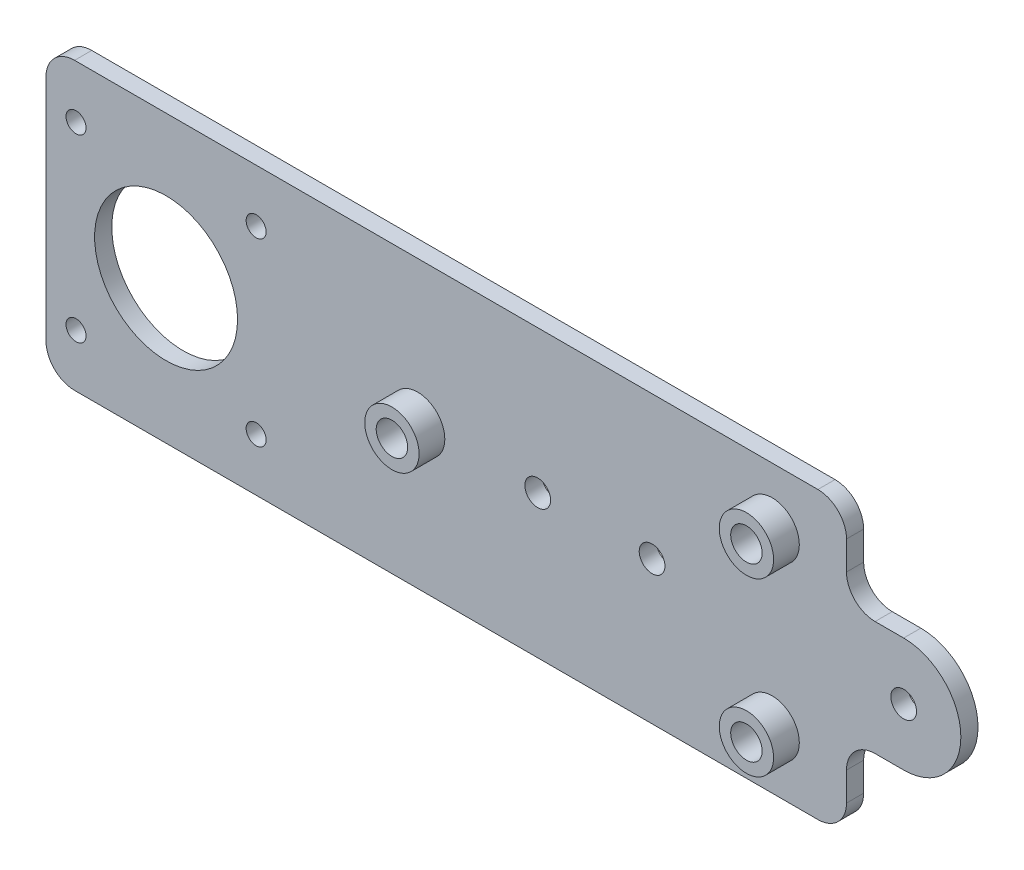
ISO-10303-21;
HEADER;
FILE_DESCRIPTION(('STEP AP214'),'2;1');
FILE_NAME('part.step','',(''),(''),'','','');
FILE_SCHEMA(('AUTOMOTIVE_DESIGN { 1 0 10303 214 1 1 1 1 }'));
ENDSEC;
DATA;
#1=APPLICATION_CONTEXT('core data for automotive mechanical design processes');
#2=APPLICATION_PROTOCOL_DEFINITION('international standard','automotive_design',2000,#1);
#3=PRODUCT_CONTEXT('',#1,'mechanical');
#4=PRODUCT('Part','Part','',(#3));
#5=PRODUCT_RELATED_PRODUCT_CATEGORY('part','',(#4));
#6=PRODUCT_DEFINITION_FORMATION('','',#4);
#7=PRODUCT_DEFINITION_CONTEXT('part definition',#1,'design');
#8=PRODUCT_DEFINITION('design','',#6,#7);
#9=PRODUCT_DEFINITION_SHAPE('','',#8);
#10=(LENGTH_UNIT() NAMED_UNIT(*) SI_UNIT(.MILLI.,.METRE.));
#11=(NAMED_UNIT(*) PLANE_ANGLE_UNIT() SI_UNIT($,.RADIAN.));
#12=(NAMED_UNIT(*) SI_UNIT($,.STERADIAN.) SOLID_ANGLE_UNIT());
#13=UNCERTAINTY_MEASURE_WITH_UNIT(LENGTH_MEASURE(1.E-05),#10,'distance_accuracy_value','');
#14=(GEOMETRIC_REPRESENTATION_CONTEXT(3) GLOBAL_UNCERTAINTY_ASSIGNED_CONTEXT((#13)) GLOBAL_UNIT_ASSIGNED_CONTEXT((#10,
#11,#12)) REPRESENTATION_CONTEXT('',''));
#15=CARTESIAN_POINT('',(0.,0.,0.));
#16=DIRECTION('',(0.,0.,1.));
#17=DIRECTION('',(1.,0.,0.));
#18=AXIS2_PLACEMENT_3D('',#15,#16,#17);
#19=CARTESIAN_POINT('',(70.,20.,3.));
#20=DIRECTION('',(-1.,0.,0.));
#21=DIRECTION('',(0.,0.,1.));
#22=AXIS2_PLACEMENT_3D('',#19,#20,#21);
#23=PLANE('',#22);
#24=DIRECTION('',(0.,1.,0.));
#25=VECTOR('',#24,1.);
#26=CARTESIAN_POINT('',(70.,20.,0.));
#27=LINE('',#26,#25);
#28=CARTESIAN_POINT('',(70.,-20.,0.));
#29=VERTEX_POINT('',#28);
#30=CARTESIAN_POINT('',(70.,-15.,0.));
#31=VERTEX_POINT('',#30);
#32=EDGE_CURVE('E259',#29,#31,#27,.T.);
#33=ORIENTED_EDGE('',*,*,#32,.T.);
#34=DIRECTION('',(0.,0.,-1.));
#35=VECTOR('',#34,1.);
#36=CARTESIAN_POINT('',(70.,-15.,3.));
#37=LINE('',#36,#35);
#38=CARTESIAN_POINT('',(70.,-15.,3.));
#39=VERTEX_POINT('',#38);
#40=EDGE_CURVE('E298',#31,#39,#37,.F.);
#41=ORIENTED_EDGE('',*,*,#40,.T.);
#42=DIRECTION('',(0.,1.,0.));
#43=VECTOR('',#42,1.);
#44=CARTESIAN_POINT('',(70.,20.,3.));
#45=LINE('',#44,#43);
#46=CARTESIAN_POINT('',(70.,-20.,3.));
#47=VERTEX_POINT('',#46);
#48=EDGE_CURVE('E241',#47,#39,#45,.T.);
#49=ORIENTED_EDGE('',*,*,#48,.F.);
#50=DIRECTION('',(0.,0.,-1.));
#51=VECTOR('',#50,1.);
#52=CARTESIAN_POINT('',(70.,-20.,3.));
#53=LINE('',#52,#51);
#54=EDGE_CURVE('E293',#47,#29,#53,.T.);
#55=ORIENTED_EDGE('',*,*,#54,.T.);
#56=EDGE_LOOP('',(#33,#41,#49,#55));
#57=FACE_BOUND('',#56,.T.);
#58=ADVANCED_FACE('F38',(#57),#23,.F.);
#59=CARTESIAN_POINT('',(65.,-20.,3.));
#60=DIRECTION('',(0.,0.,1.));
#61=DIRECTION('',(1.,0.,0.));
#62=AXIS2_PLACEMENT_3D('',#59,#60,#61);
#63=PLANE('',#62);
#64=CARTESIAN_POINT('',(16.,0.,3.));
#65=DIRECTION('',(0.,0.,1.));
#66=DIRECTION('',(1.,0.,0.));
#67=AXIS2_PLACEMENT_3D('',#64,#65,#66);
#68=CIRCLE('',#67,2.25);
#69=CARTESIAN_POINT('',(18.25,0.,3.));
#70=VERTEX_POINT('',#69);
#71=EDGE_CURVE('E370',#70,#70,#68,.T.);
#72=ORIENTED_EDGE('',*,*,#71,.F.);
#73=EDGE_LOOP('',(#72));
#74=FACE_BOUND('',#73,.T.);
#75=CARTESIAN_POINT('',(36.,0.,3.));
#76=DIRECTION('',(0.,0.,1.));
#77=DIRECTION('',(1.,0.,0.));
#78=AXIS2_PLACEMENT_3D('',#75,#76,#77);
#79=CIRCLE('',#78,2.25);
#80=CARTESIAN_POINT('',(38.25,0.,3.));
#81=VERTEX_POINT('',#80);
#82=EDGE_CURVE('E367',#81,#81,#79,.T.);
#83=ORIENTED_EDGE('',*,*,#82,.F.);
#84=EDGE_LOOP('',(#83));
#85=FACE_BOUND('',#84,.T.);
#86=CARTESIAN_POINT('',(-4.99999999999999,0.,3.));
#87=DIRECTION('',(0.,0.,1.));
#88=DIRECTION('',(1.,0.,0.));
#89=AXIS2_PLACEMENT_3D('',#86,#87,#88);
#90=CIRCLE('',#89,4.75);
#91=CARTESIAN_POINT('',(-0.249999999999989,0.,3.));
#92=VERTEX_POINT('',#91);
#93=EDGE_CURVE('E180',#92,#92,#90,.T.);
#94=ORIENTED_EDGE('',*,*,#93,.F.);
#95=EDGE_LOOP('',(#94));
#96=FACE_BOUND('',#95,.T.);
#97=CARTESIAN_POINT('',(65.,-20.,3.));
#98=DIRECTION('',(0.,0.,1.));
#99=DIRECTION('',(1.,0.,0.));
#100=AXIS2_PLACEMENT_3D('',#97,#98,#99);
#101=CIRCLE('',#100,5.);
#102=CARTESIAN_POINT('',(65.,-25.,3.));
#103=VERTEX_POINT('',#102);
#104=EDGE_CURVE('E237',#103,#47,#101,.T.);
#105=ORIENTED_EDGE('',*,*,#104,.T.);
#106=ORIENTED_EDGE('',*,*,#48,.T.);
#107=CARTESIAN_POINT('',(75.,-15.,3.));
#108=DIRECTION('',(0.,0.,1.));
#109=DIRECTION('',(1.,0.,0.));
#110=AXIS2_PLACEMENT_3D('',#107,#108,#109);
#111=CIRCLE('',#110,5.);
#112=CARTESIAN_POINT('',(75.,-10.,3.));
#113=VERTEX_POINT('',#112);
#114=EDGE_CURVE('E146',#39,#113,#111,.F.);
#115=ORIENTED_EDGE('',*,*,#114,.T.);
#116=DIRECTION('',(1.,0.,0.));
#117=VECTOR('',#116,1.);
#118=CARTESIAN_POINT('',(0.,-10.0000000000002,3.));
#119=LINE('',#118,#117);
#120=CARTESIAN_POINT('',(80.,-10.,3.));
#121=VERTEX_POINT('',#120);
#122=EDGE_CURVE('E137',#113,#121,#119,.T.);
#123=ORIENTED_EDGE('',*,*,#122,.T.);
#124=CARTESIAN_POINT('',(80.,0.,3.));
#125=DIRECTION('',(0.,0.,1.));
#126=DIRECTION('',(1.,0.,0.));
#127=AXIS2_PLACEMENT_3D('',#124,#125,#126);
#128=CIRCLE('',#127,10.);
#129=CARTESIAN_POINT('',(80.,10.,3.));
#130=VERTEX_POINT('',#129);
#131=EDGE_CURVE('E142',#121,#130,#128,.T.);
#132=ORIENTED_EDGE('',*,*,#131,.T.);
#133=DIRECTION('',(1.,0.,0.));
#134=VECTOR('',#133,1.);
#135=CARTESIAN_POINT('',(0.,9.99999999999985,3.));
#136=LINE('',#135,#134);
#137=CARTESIAN_POINT('',(75.,9.99999999999999,3.));
#138=VERTEX_POINT('',#137);
#139=EDGE_CURVE('E160',#138,#130,#136,.T.);
#140=ORIENTED_EDGE('',*,*,#139,.F.);
#141=CARTESIAN_POINT('',(75.,15.,3.));
#142=DIRECTION('',(0.,0.,1.));
#143=DIRECTION('',(1.,0.,0.));
#144=AXIS2_PLACEMENT_3D('',#141,#142,#143);
#145=CIRCLE('',#144,5.);
#146=CARTESIAN_POINT('',(70.,15.,3.));
#147=VERTEX_POINT('',#146);
#148=EDGE_CURVE('E11',#138,#147,#145,.F.);
#149=ORIENTED_EDGE('',*,*,#148,.T.);
#150=CARTESIAN_POINT('',(70.,20.,3.));
#151=VERTEX_POINT('',#150);
#152=EDGE_CURVE('E239',#147,#151,#45,.T.);
#153=ORIENTED_EDGE('',*,*,#152,.T.);
#154=CARTESIAN_POINT('',(65.,20.,3.));
#155=DIRECTION('',(0.,0.,1.));
#156=DIRECTION('',(-1.,0.,0.));
#157=AXIS2_PLACEMENT_3D('',#154,#155,#156);
#158=CIRCLE('',#157,5.);
#159=CARTESIAN_POINT('',(65.,25.,3.));
#160=VERTEX_POINT('',#159);
#161=EDGE_CURVE('E243',#151,#160,#158,.T.);
#162=ORIENTED_EDGE('',*,*,#161,.T.);
#163=DIRECTION('',(-1.,0.,0.));
#164=VECTOR('',#163,1.);
#165=CARTESIAN_POINT('',(-65.,25.,3.));
#166=LINE('',#165,#164);
#167=CARTESIAN_POINT('',(-65.,25.,3.));
#168=VERTEX_POINT('',#167);
#169=EDGE_CURVE('E245',#160,#168,#166,.T.);
#170=ORIENTED_EDGE('',*,*,#169,.T.);
#171=CARTESIAN_POINT('',(-65.,20.,3.));
#172=DIRECTION('',(0.,0.,1.));
#173=DIRECTION('',(1.,0.,0.));
#174=AXIS2_PLACEMENT_3D('',#171,#172,#173);
#175=CIRCLE('',#174,5.);
#176=CARTESIAN_POINT('',(-70.,20.,3.));
#177=VERTEX_POINT('',#176);
#178=EDGE_CURVE('E247',#168,#177,#175,.T.);
#179=ORIENTED_EDGE('',*,*,#178,.T.);
#180=DIRECTION('',(0.,-1.,0.));
#181=VECTOR('',#180,1.);
#182=CARTESIAN_POINT('',(-70.,20.,3.));
#183=LINE('',#182,#181);
#184=CARTESIAN_POINT('',(-70.,-20.,3.));
#185=VERTEX_POINT('',#184);
#186=EDGE_CURVE('E249',#177,#185,#183,.T.);
#187=ORIENTED_EDGE('',*,*,#186,.T.);
#188=CARTESIAN_POINT('',(-65.,-20.,3.));
#189=DIRECTION('',(0.,0.,1.));
#190=DIRECTION('',(1.,0.,0.));
#191=AXIS2_PLACEMENT_3D('',#188,#189,#190);
#192=CIRCLE('',#191,5.);
#193=CARTESIAN_POINT('',(-65.,-25.,3.));
#194=VERTEX_POINT('',#193);
#195=EDGE_CURVE('E251',#185,#194,#192,.T.);
#196=ORIENTED_EDGE('',*,*,#195,.T.);
#197=DIRECTION('',(1.,0.,0.));
#198=VECTOR('',#197,1.);
#199=CARTESIAN_POINT('',(-65.,-25.,3.));
#200=LINE('',#199,#198);
#201=EDGE_CURVE('E253',#194,#103,#200,.T.);
#202=ORIENTED_EDGE('',*,*,#201,.T.);
#203=EDGE_LOOP('',(#105,#106,#115,#123,#132,#140,#149,#153,#162,#170,#179,#187,#196,#202));
#204=FACE_BOUND('',#203,.T.);
#205=CARTESIAN_POINT('',(-64.75,15.75,3.));
#206=DIRECTION('',(0.,0.,1.));
#207=DIRECTION('',(1.,0.,0.));
#208=AXIS2_PLACEMENT_3D('',#205,#206,#207);
#209=CIRCLE('',#208,1.75);
#210=CARTESIAN_POINT('',(-63.,15.75,3.));
#211=VERTEX_POINT('',#210);
#212=EDGE_CURVE('E215',#211,#211,#209,.T.);
#213=ORIENTED_EDGE('',*,*,#212,.F.);
#214=EDGE_LOOP('',(#213));
#215=FACE_BOUND('',#214,.T.);
#216=CARTESIAN_POINT('',(-49.,0.,3.));
#217=DIRECTION('',(0.,0.,1.));
#218=DIRECTION('',(1.,0.,0.));
#219=AXIS2_PLACEMENT_3D('',#216,#217,#218);
#220=CIRCLE('',#219,12.5);
#221=CARTESIAN_POINT('',(-36.5,0.,3.));
#222=VERTEX_POINT('',#221);
#223=EDGE_CURVE('E205',#222,#222,#220,.T.);
#224=ORIENTED_EDGE('',*,*,#223,.F.);
#225=EDGE_LOOP('',(#224));
#226=FACE_BOUND('',#225,.T.);
#227=CARTESIAN_POINT('',(-33.25,-15.75,3.));
#228=DIRECTION('',(0.,0.,1.));
#229=DIRECTION('',(1.,0.,0.));
#230=AXIS2_PLACEMENT_3D('',#227,#228,#229);
#231=CIRCLE('',#230,1.75);
#232=CARTESIAN_POINT('',(-31.5,-15.75,3.));
#233=VERTEX_POINT('',#232);
#234=EDGE_CURVE('E198',#233,#233,#231,.T.);
#235=ORIENTED_EDGE('',*,*,#234,.F.);
#236=EDGE_LOOP('',(#235));
#237=FACE_BOUND('',#236,.T.);
#238=CARTESIAN_POINT('',(-64.75,-15.75,3.));
#239=DIRECTION('',(0.,0.,1.));
#240=DIRECTION('',(1.,0.,0.));
#241=AXIS2_PLACEMENT_3D('',#238,#239,#240);
#242=CIRCLE('',#241,1.75);
#243=CARTESIAN_POINT('',(-63.,-15.75,3.));
#244=VERTEX_POINT('',#243);
#245=EDGE_CURVE('E219',#244,#244,#242,.T.);
#246=ORIENTED_EDGE('',*,*,#245,.F.);
#247=EDGE_LOOP('',(#246));
#248=FACE_BOUND('',#247,.T.);
#249=CARTESIAN_POINT('',(-33.25,15.75,3.));
#250=DIRECTION('',(0.,0.,1.));
#251=DIRECTION('',(1.,0.,0.));
#252=AXIS2_PLACEMENT_3D('',#249,#250,#251);
#253=CIRCLE('',#252,1.75);
#254=CARTESIAN_POINT('',(-31.5,15.75,3.));
#255=VERTEX_POINT('',#254);
#256=EDGE_CURVE('E212',#255,#255,#253,.T.);
#257=ORIENTED_EDGE('',*,*,#256,.F.);
#258=EDGE_LOOP('',(#257));
#259=FACE_BOUND('',#258,.T.);
#260=CARTESIAN_POINT('',(57.,15.,3.));
#261=DIRECTION('',(0.,0.,1.));
#262=DIRECTION('',(1.,0.,0.));
#263=AXIS2_PLACEMENT_3D('',#260,#261,#262);
#264=CIRCLE('',#263,4.75);
#265=CARTESIAN_POINT('',(61.75,15.,3.));
#266=VERTEX_POINT('',#265);
#267=EDGE_CURVE('E191',#266,#266,#264,.T.);
#268=ORIENTED_EDGE('',*,*,#267,.F.);
#269=EDGE_LOOP('',(#268));
#270=FACE_BOUND('',#269,.T.);
#271=CARTESIAN_POINT('',(57.,-15.,3.));
#272=DIRECTION('',(0.,0.,1.));
#273=DIRECTION('',(1.,0.,0.));
#274=AXIS2_PLACEMENT_3D('',#271,#272,#273);
#275=CIRCLE('',#274,4.75);
#276=CARTESIAN_POINT('',(61.75,-15.,3.));
#277=VERTEX_POINT('',#276);
#278=EDGE_CURVE('E169',#277,#277,#275,.T.);
#279=ORIENTED_EDGE('',*,*,#278,.F.);
#280=EDGE_LOOP('',(#279));
#281=FACE_BOUND('',#280,.T.);
#282=CARTESIAN_POINT('',(80.,0.,3.));
#283=DIRECTION('',(0.,0.,1.));
#284=DIRECTION('',(1.,0.,0.));
#285=AXIS2_PLACEMENT_3D('',#282,#283,#284);
#286=CIRCLE('',#285,2.25);
#287=CARTESIAN_POINT('',(82.25,0.,3.));
#288=VERTEX_POINT('',#287);
#289=EDGE_CURVE('E151',#288,#288,#286,.T.);
#290=ORIENTED_EDGE('',*,*,#289,.F.);
#291=EDGE_LOOP('',(#290));
#292=FACE_BOUND('',#291,.T.);
#293=ADVANCED_FACE('F140',(#74,#85,#96,#204,#215,#226,#237,#248,#259,#270,#281,#292),#63,.T.);
#294=CARTESIAN_POINT('',(65.,-20.,3.));
#295=DIRECTION('',(0.,0.,-1.));
#296=DIRECTION('',(-1.,0.,0.));
#297=AXIS2_PLACEMENT_3D('',#294,#295,#296);
#298=CYLINDRICAL_SURFACE('',#297,5.);
#299=CARTESIAN_POINT('',(65.,-20.,0.));
#300=DIRECTION('',(0.,0.,1.));
#301=DIRECTION('',(1.,0.,0.));
#302=AXIS2_PLACEMENT_3D('',#299,#300,#301);
#303=CIRCLE('',#302,5.);
#304=CARTESIAN_POINT('',(65.,-25.,0.));
#305=VERTEX_POINT('',#304);
#306=EDGE_CURVE('E234',#305,#29,#303,.T.);
#307=ORIENTED_EDGE('',*,*,#306,.T.);
#308=ORIENTED_EDGE('',*,*,#54,.F.);
#309=ORIENTED_EDGE('',*,*,#104,.F.);
#310=DIRECTION('',(0.,0.,-1.));
#311=VECTOR('',#310,1.);
#312=CARTESIAN_POINT('',(65.,-25.,3.));
#313=LINE('',#312,#311);
#314=EDGE_CURVE('E255',#103,#305,#313,.T.);
#315=ORIENTED_EDGE('',*,*,#314,.T.);
#316=EDGE_LOOP('',(#307,#308,#309,#315));
#317=FACE_BOUND('',#316,.T.);
#318=ADVANCED_FACE('F332',(#317),#298,.T.);
#319=ORIENTED_EDGE('',*,*,#152,.F.);
#320=DIRECTION('',(0.,0.,-1.));
#321=VECTOR('',#320,1.);
#322=CARTESIAN_POINT('',(70.,15.,3.));
#323=LINE('',#322,#321);
#324=CARTESIAN_POINT('',(70.,15.,0.));
#325=VERTEX_POINT('',#324);
#326=EDGE_CURVE('E300',#147,#325,#323,.T.);
#327=ORIENTED_EDGE('',*,*,#326,.T.);
#328=CARTESIAN_POINT('',(70.,20.,0.));
#329=VERTEX_POINT('',#328);
#330=EDGE_CURVE('E258',#325,#329,#27,.T.);
#331=ORIENTED_EDGE('',*,*,#330,.T.);
#332=DIRECTION('',(0.,0.,-1.));
#333=VECTOR('',#332,1.);
#334=CARTESIAN_POINT('',(70.,20.,3.));
#335=LINE('',#334,#333);
#336=EDGE_CURVE('E290',#151,#329,#335,.T.);
#337=ORIENTED_EDGE('',*,*,#336,.F.);
#338=EDGE_LOOP('',(#319,#327,#331,#337));
#339=FACE_BOUND('',#338,.T.);
#340=ADVANCED_FACE('F328',(#339),#23,.F.);
#341=CARTESIAN_POINT('',(65.,20.,3.));
#342=DIRECTION('',(0.,0.,-1.));
#343=DIRECTION('',(-1.,0.,0.));
#344=AXIS2_PLACEMENT_3D('',#341,#342,#343);
#345=CYLINDRICAL_SURFACE('',#344,5.);
#346=CARTESIAN_POINT('',(65.,20.,0.));
#347=DIRECTION('',(0.,0.,1.));
#348=DIRECTION('',(-1.,0.,0.));
#349=AXIS2_PLACEMENT_3D('',#346,#347,#348);
#350=CIRCLE('',#349,5.);
#351=CARTESIAN_POINT('',(65.,25.,0.));
#352=VERTEX_POINT('',#351);
#353=EDGE_CURVE('E262',#329,#352,#350,.T.);
#354=ORIENTED_EDGE('',*,*,#353,.T.);
#355=DIRECTION('',(0.,0.,-1.));
#356=VECTOR('',#355,1.);
#357=CARTESIAN_POINT('',(65.,25.,3.));
#358=LINE('',#357,#356);
#359=EDGE_CURVE('E287',#160,#352,#358,.T.);
#360=ORIENTED_EDGE('',*,*,#359,.F.);
#361=ORIENTED_EDGE('',*,*,#161,.F.);
#362=ORIENTED_EDGE('',*,*,#336,.T.);
#363=EDGE_LOOP('',(#354,#360,#361,#362));
#364=FACE_BOUND('',#363,.T.);
#365=ADVANCED_FACE('F337',(#364),#345,.T.);
#366=CARTESIAN_POINT('',(-65.,25.,3.));
#367=DIRECTION('',(0.,-1.,0.));
#368=DIRECTION('',(0.,0.,-1.));
#369=AXIS2_PLACEMENT_3D('',#366,#367,#368);
#370=PLANE('',#369);
#371=DIRECTION('',(-1.,0.,0.));
#372=VECTOR('',#371,1.);
#373=CARTESIAN_POINT('',(-65.,25.,0.));
#374=LINE('',#373,#372);
#375=CARTESIAN_POINT('',(-65.,25.,0.));
#376=VERTEX_POINT('',#375);
#377=EDGE_CURVE('E264',#352,#376,#374,.T.);
#378=ORIENTED_EDGE('',*,*,#377,.T.);
#379=DIRECTION('',(0.,0.,-1.));
#380=VECTOR('',#379,1.);
#381=CARTESIAN_POINT('',(-65.,25.,3.));
#382=LINE('',#381,#380);
#383=EDGE_CURVE('E284',#168,#376,#382,.T.);
#384=ORIENTED_EDGE('',*,*,#383,.F.);
#385=ORIENTED_EDGE('',*,*,#169,.F.);
#386=ORIENTED_EDGE('',*,*,#359,.T.);
#387=EDGE_LOOP('',(#378,#384,#385,#386));
#388=FACE_BOUND('',#387,.T.);
#389=ADVANCED_FACE('F343',(#388),#370,.F.);
#390=CARTESIAN_POINT('',(-65.,20.,3.));
#391=DIRECTION('',(0.,0.,-1.));
#392=DIRECTION('',(-1.,0.,0.));
#393=AXIS2_PLACEMENT_3D('',#390,#391,#392);
#394=CYLINDRICAL_SURFACE('',#393,5.);
#395=CARTESIAN_POINT('',(-65.,20.,0.));
#396=DIRECTION('',(0.,0.,1.));
#397=DIRECTION('',(1.,0.,0.));
#398=AXIS2_PLACEMENT_3D('',#395,#396,#397);
#399=CIRCLE('',#398,5.);
#400=CARTESIAN_POINT('',(-70.,20.,0.));
#401=VERTEX_POINT('',#400);
#402=EDGE_CURVE('E266',#376,#401,#399,.T.);
#403=ORIENTED_EDGE('',*,*,#402,.T.);
#404=DIRECTION('',(0.,0.,-1.));
#405=VECTOR('',#404,1.);
#406=CARTESIAN_POINT('',(-70.,20.,3.));
#407=LINE('',#406,#405);
#408=EDGE_CURVE('E281',#177,#401,#407,.T.);
#409=ORIENTED_EDGE('',*,*,#408,.F.);
#410=ORIENTED_EDGE('',*,*,#178,.F.);
#411=ORIENTED_EDGE('',*,*,#383,.T.);
#412=EDGE_LOOP('',(#403,#409,#410,#411));
#413=FACE_BOUND('',#412,.T.);
#414=ADVANCED_FACE('F459',(#413),#394,.T.);
#415=CARTESIAN_POINT('',(-70.,20.,3.));
#416=DIRECTION('',(1.,0.,0.));
#417=DIRECTION('',(0.,0.,-1.));
#418=AXIS2_PLACEMENT_3D('',#415,#416,#417);
#419=PLANE('',#418);
#420=DIRECTION('',(0.,-1.,0.));
#421=VECTOR('',#420,1.);
#422=CARTESIAN_POINT('',(-70.,20.,0.));
#423=LINE('',#422,#421);
#424=CARTESIAN_POINT('',(-70.,-20.,0.));
#425=VERTEX_POINT('',#424);
#426=EDGE_CURVE('E268',#401,#425,#423,.T.);
#427=ORIENTED_EDGE('',*,*,#426,.T.);
#428=DIRECTION('',(0.,0.,-1.));
#429=VECTOR('',#428,1.);
#430=CARTESIAN_POINT('',(-70.,-20.,3.));
#431=LINE('',#430,#429);
#432=EDGE_CURVE('E278',#185,#425,#431,.T.);
#433=ORIENTED_EDGE('',*,*,#432,.F.);
#434=ORIENTED_EDGE('',*,*,#186,.F.);
#435=ORIENTED_EDGE('',*,*,#408,.T.);
#436=EDGE_LOOP('',(#427,#433,#434,#435));
#437=FACE_BOUND('',#436,.T.);
#438=ADVANCED_FACE('F455',(#437),#419,.F.);
#439=CARTESIAN_POINT('',(-65.,-20.,3.));
#440=DIRECTION('',(0.,0.,-1.));
#441=DIRECTION('',(-1.,0.,0.));
#442=AXIS2_PLACEMENT_3D('',#439,#440,#441);
#443=CYLINDRICAL_SURFACE('',#442,5.);
#444=CARTESIAN_POINT('',(-65.,-20.,0.));
#445=DIRECTION('',(0.,0.,1.));
#446=DIRECTION('',(1.,0.,0.));
#447=AXIS2_PLACEMENT_3D('',#444,#445,#446);
#448=CIRCLE('',#447,5.);
#449=CARTESIAN_POINT('',(-65.,-25.,0.));
#450=VERTEX_POINT('',#449);
#451=EDGE_CURVE('E270',#425,#450,#448,.T.);
#452=ORIENTED_EDGE('',*,*,#451,.T.);
#453=DIRECTION('',(0.,0.,-1.));
#454=VECTOR('',#453,1.);
#455=CARTESIAN_POINT('',(-65.,-25.,3.));
#456=LINE('',#455,#454);
#457=EDGE_CURVE('E275',#194,#450,#456,.T.);
#458=ORIENTED_EDGE('',*,*,#457,.F.);
#459=ORIENTED_EDGE('',*,*,#195,.F.);
#460=ORIENTED_EDGE('',*,*,#432,.T.);
#461=EDGE_LOOP('',(#452,#458,#459,#460));
#462=FACE_BOUND('',#461,.T.);
#463=ADVANCED_FACE('F451',(#462),#443,.T.);
#464=CARTESIAN_POINT('',(-65.,-25.,3.));
#465=DIRECTION('',(0.,1.,0.));
#466=DIRECTION('',(0.,0.,1.));
#467=AXIS2_PLACEMENT_3D('',#464,#465,#466);
#468=PLANE('',#467);
#469=DIRECTION('',(1.,0.,0.));
#470=VECTOR('',#469,1.);
#471=CARTESIAN_POINT('',(-65.,-25.,0.));
#472=LINE('',#471,#470);
#473=EDGE_CURVE('E240',#450,#305,#472,.T.);
#474=ORIENTED_EDGE('',*,*,#473,.T.);
#475=ORIENTED_EDGE('',*,*,#314,.F.);
#476=ORIENTED_EDGE('',*,*,#201,.F.);
#477=ORIENTED_EDGE('',*,*,#457,.T.);
#478=EDGE_LOOP('',(#474,#475,#476,#477));
#479=FACE_BOUND('',#478,.T.);
#480=ADVANCED_FACE('F448',(#479),#468,.F.);
#481=CARTESIAN_POINT('',(65.,-20.,0.));
#482=DIRECTION('',(0.,0.,1.));
#483=DIRECTION('',(1.,0.,0.));
#484=AXIS2_PLACEMENT_3D('',#481,#482,#483);
#485=PLANE('',#484);
#486=CARTESIAN_POINT('',(16.,0.,0.));
#487=DIRECTION('',(0.,0.,1.));
#488=DIRECTION('',(1.,0.,0.));
#489=AXIS2_PLACEMENT_3D('',#486,#487,#488);
#490=CIRCLE('',#489,2.25);
#491=CARTESIAN_POINT('',(18.25,0.,0.));
#492=VERTEX_POINT('',#491);
#493=EDGE_CURVE('E356',#492,#492,#490,.T.);
#494=ORIENTED_EDGE('',*,*,#493,.T.);
#495=EDGE_LOOP('',(#494));
#496=FACE_BOUND('',#495,.T.);
#497=CARTESIAN_POINT('',(36.,0.,0.));
#498=DIRECTION('',(0.,0.,1.));
#499=DIRECTION('',(1.,0.,0.));
#500=AXIS2_PLACEMENT_3D('',#497,#498,#499);
#501=CIRCLE('',#500,2.25);
#502=CARTESIAN_POINT('',(38.25,0.,0.));
#503=VERTEX_POINT('',#502);
#504=EDGE_CURVE('E364',#503,#503,#501,.T.);
#505=ORIENTED_EDGE('',*,*,#504,.T.);
#506=EDGE_LOOP('',(#505));
#507=FACE_BOUND('',#506,.T.);
#508=CARTESIAN_POINT('',(-4.99999999999999,0.,0.));
#509=DIRECTION('',(0.,0.,1.));
#510=DIRECTION('',(1.,0.,0.));
#511=AXIS2_PLACEMENT_3D('',#508,#509,#510);
#512=CIRCLE('',#511,2.75);
#513=CARTESIAN_POINT('',(-2.24999999999999,0.,0.));
#514=VERTEX_POINT('',#513);
#515=EDGE_CURVE('E195',#514,#514,#512,.T.);
#516=ORIENTED_EDGE('',*,*,#515,.T.);
#517=EDGE_LOOP('',(#516));
#518=FACE_BOUND('',#517,.T.);
#519=CARTESIAN_POINT('',(57.,-15.,0.));
#520=DIRECTION('',(0.,0.,1.));
#521=DIRECTION('',(1.,0.,0.));
#522=AXIS2_PLACEMENT_3D('',#519,#520,#521);
#523=CIRCLE('',#522,2.75);
#524=CARTESIAN_POINT('',(59.75,-15.,0.));
#525=VERTEX_POINT('',#524);
#526=EDGE_CURVE('E226',#525,#525,#523,.T.);
#527=ORIENTED_EDGE('',*,*,#526,.T.);
#528=EDGE_LOOP('',(#527));
#529=FACE_BOUND('',#528,.T.);
#530=CARTESIAN_POINT('',(57.,15.,0.));
#531=DIRECTION('',(0.,0.,1.));
#532=DIRECTION('',(1.,0.,0.));
#533=AXIS2_PLACEMENT_3D('',#530,#531,#532);
#534=CIRCLE('',#533,2.75);
#535=CARTESIAN_POINT('',(59.75,15.,0.));
#536=VERTEX_POINT('',#535);
#537=EDGE_CURVE('E211',#536,#536,#534,.T.);
#538=ORIENTED_EDGE('',*,*,#537,.T.);
#539=EDGE_LOOP('',(#538));
#540=FACE_BOUND('',#539,.T.);
#541=CARTESIAN_POINT('',(-33.25,15.75,0.));
#542=DIRECTION('',(0.,0.,1.));
#543=DIRECTION('',(1.,0.,0.));
#544=AXIS2_PLACEMENT_3D('',#541,#542,#543);
#545=CIRCLE('',#544,1.75);
#546=CARTESIAN_POINT('',(-31.5,15.75,0.));
#547=VERTEX_POINT('',#546);
#548=EDGE_CURVE('E216',#547,#547,#545,.T.);
#549=ORIENTED_EDGE('',*,*,#548,.T.);
#550=EDGE_LOOP('',(#549));
#551=FACE_BOUND('',#550,.T.);
#552=CARTESIAN_POINT('',(-64.75,-15.75,0.));
#553=DIRECTION('',(0.,0.,1.));
#554=DIRECTION('',(1.,0.,0.));
#555=AXIS2_PLACEMENT_3D('',#552,#553,#554);
#556=CIRCLE('',#555,1.75);
#557=CARTESIAN_POINT('',(-63.,-15.75,0.));
#558=VERTEX_POINT('',#557);
#559=EDGE_CURVE('E201',#558,#558,#556,.T.);
#560=ORIENTED_EDGE('',*,*,#559,.T.);
#561=EDGE_LOOP('',(#560));
#562=FACE_BOUND('',#561,.T.);
#563=CARTESIAN_POINT('',(-33.25,-15.75,0.));
#564=DIRECTION('',(0.,0.,1.));
#565=DIRECTION('',(1.,0.,0.));
#566=AXIS2_PLACEMENT_3D('',#563,#564,#565);
#567=CIRCLE('',#566,1.75);
#568=CARTESIAN_POINT('',(-31.5,-15.75,0.));
#569=VERTEX_POINT('',#568);
#570=EDGE_CURVE('E202',#569,#569,#567,.T.);
#571=ORIENTED_EDGE('',*,*,#570,.T.);
#572=EDGE_LOOP('',(#571));
#573=FACE_BOUND('',#572,.T.);
#574=CARTESIAN_POINT('',(-49.,0.,0.));
#575=DIRECTION('',(0.,0.,1.));
#576=DIRECTION('',(1.,0.,0.));
#577=AXIS2_PLACEMENT_3D('',#574,#575,#576);
#578=CIRCLE('',#577,12.5);
#579=CARTESIAN_POINT('',(-36.5,0.,0.));
#580=VERTEX_POINT('',#579);
#581=EDGE_CURVE('E208',#580,#580,#578,.T.);
#582=ORIENTED_EDGE('',*,*,#581,.T.);
#583=EDGE_LOOP('',(#582));
#584=FACE_BOUND('',#583,.T.);
#585=CARTESIAN_POINT('',(-64.75,15.75,0.));
#586=DIRECTION('',(0.,0.,1.));
#587=DIRECTION('',(1.,0.,0.));
#588=AXIS2_PLACEMENT_3D('',#585,#586,#587);
#589=CIRCLE('',#588,1.75);
#590=CARTESIAN_POINT('',(-63.,15.75,0.));
#591=VERTEX_POINT('',#590);
#592=EDGE_CURVE('E231',#591,#591,#589,.T.);
#593=ORIENTED_EDGE('',*,*,#592,.T.);
#594=EDGE_LOOP('',(#593));
#595=FACE_BOUND('',#594,.T.);
#596=ORIENTED_EDGE('',*,*,#306,.F.);
#597=ORIENTED_EDGE('',*,*,#473,.F.);
#598=ORIENTED_EDGE('',*,*,#451,.F.);
#599=ORIENTED_EDGE('',*,*,#426,.F.);
#600=ORIENTED_EDGE('',*,*,#402,.F.);
#601=ORIENTED_EDGE('',*,*,#377,.F.);
#602=ORIENTED_EDGE('',*,*,#353,.F.);
#603=ORIENTED_EDGE('',*,*,#330,.F.);
#604=CARTESIAN_POINT('',(75.,15.,0.));
#605=DIRECTION('',(0.,0.,1.));
#606=DIRECTION('',(1.,0.,0.));
#607=AXIS2_PLACEMENT_3D('',#604,#605,#606);
#608=CIRCLE('',#607,5.);
#609=CARTESIAN_POINT('',(75.,9.99999999999999,0.));
#610=VERTEX_POINT('',#609);
#611=EDGE_CURVE('E46',#325,#610,#608,.T.);
#612=ORIENTED_EDGE('',*,*,#611,.T.);
#613=DIRECTION('',(1.,0.,0.));
#614=VECTOR('',#613,1.);
#615=CARTESIAN_POINT('',(0.,9.99999999999985,0.));
#616=LINE('',#615,#614);
#617=CARTESIAN_POINT('',(80.,10.,0.));
#618=VERTEX_POINT('',#617);
#619=EDGE_CURVE('E359',#610,#618,#616,.T.);
#620=ORIENTED_EDGE('',*,*,#619,.T.);
#621=CARTESIAN_POINT('',(80.,0.,0.));
#622=DIRECTION('',(0.,0.,1.));
#623=DIRECTION('',(1.,0.,0.));
#624=AXIS2_PLACEMENT_3D('',#621,#622,#623);
#625=CIRCLE('',#624,10.);
#626=CARTESIAN_POINT('',(80.,-10.,0.));
#627=VERTEX_POINT('',#626);
#628=EDGE_CURVE('E358',#627,#618,#625,.T.);
#629=ORIENTED_EDGE('',*,*,#628,.F.);
#630=DIRECTION('',(1.,0.,0.));
#631=VECTOR('',#630,1.);
#632=CARTESIAN_POINT('',(0.,-10.0000000000002,0.));
#633=LINE('',#632,#631);
#634=CARTESIAN_POINT('',(75.,-10.,0.));
#635=VERTEX_POINT('',#634);
#636=EDGE_CURVE('E164',#635,#627,#633,.T.);
#637=ORIENTED_EDGE('',*,*,#636,.F.);
#638=CARTESIAN_POINT('',(75.,-15.,0.));
#639=DIRECTION('',(0.,0.,1.));
#640=DIRECTION('',(1.,0.,0.));
#641=AXIS2_PLACEMENT_3D('',#638,#639,#640);
#642=CIRCLE('',#641,5.);
#643=EDGE_CURVE('E304',#635,#31,#642,.T.);
#644=ORIENTED_EDGE('',*,*,#643,.T.);
#645=ORIENTED_EDGE('',*,*,#32,.F.);
#646=EDGE_LOOP('',(#596,#597,#598,#599,#600,#601,#602,#603,#612,#620,#629,#637,#644,#645));
#647=FACE_BOUND('',#646,.T.);
#648=CARTESIAN_POINT('',(80.,0.,0.));
#649=DIRECTION('',(0.,0.,1.));
#650=DIRECTION('',(1.,0.,0.));
#651=AXIS2_PLACEMENT_3D('',#648,#649,#650);
#652=CIRCLE('',#651,2.25);
#653=CARTESIAN_POINT('',(82.25,0.,0.));
#654=VERTEX_POINT('',#653);
#655=EDGE_CURVE('E353',#654,#654,#652,.T.);
#656=ORIENTED_EDGE('',*,*,#655,.T.);
#657=EDGE_LOOP('',(#656));
#658=FACE_BOUND('',#657,.T.);
#659=ADVANCED_FACE('F307',(#496,#507,#518,#529,#540,#551,#562,#573,#584,#595,#647,#658),#485,.F.);
#660=CARTESIAN_POINT('',(-64.75,15.75,0.));
#661=DIRECTION('',(0.,0.,1.));
#662=DIRECTION('',(1.,0.,0.));
#663=AXIS2_PLACEMENT_3D('',#660,#661,#662);
#664=CYLINDRICAL_SURFACE('',#663,1.75);
#665=ORIENTED_EDGE('',*,*,#592,.F.);
#666=EDGE_LOOP('',(#665));
#667=FACE_BOUND('',#666,.T.);
#668=ORIENTED_EDGE('',*,*,#212,.T.);
#669=EDGE_LOOP('',(#668));
#670=FACE_BOUND('',#669,.T.);
#671=ADVANCED_FACE('F423',(#667,#670),#664,.F.);
#672=CARTESIAN_POINT('',(-49.,0.,0.));
#673=DIRECTION('',(0.,0.,1.));
#674=DIRECTION('',(1.,0.,0.));
#675=AXIS2_PLACEMENT_3D('',#672,#673,#674);
#676=CYLINDRICAL_SURFACE('',#675,12.5);
#677=ORIENTED_EDGE('',*,*,#581,.F.);
#678=EDGE_LOOP('',(#677));
#679=FACE_BOUND('',#678,.T.);
#680=ORIENTED_EDGE('',*,*,#223,.T.);
#681=EDGE_LOOP('',(#680));
#682=FACE_BOUND('',#681,.T.);
#683=ADVANCED_FACE('F419',(#679,#682),#676,.F.);
#684=CARTESIAN_POINT('',(-33.25,-15.75,0.));
#685=DIRECTION('',(0.,0.,1.));
#686=DIRECTION('',(1.,0.,0.));
#687=AXIS2_PLACEMENT_3D('',#684,#685,#686);
#688=CYLINDRICAL_SURFACE('',#687,1.75);
#689=ORIENTED_EDGE('',*,*,#570,.F.);
#690=EDGE_LOOP('',(#689));
#691=FACE_BOUND('',#690,.T.);
#692=ORIENTED_EDGE('',*,*,#234,.T.);
#693=EDGE_LOOP('',(#692));
#694=FACE_BOUND('',#693,.T.);
#695=ADVANCED_FACE('F415',(#691,#694),#688,.F.);
#696=CARTESIAN_POINT('',(-64.75,-15.75,0.));
#697=DIRECTION('',(0.,0.,1.));
#698=DIRECTION('',(1.,0.,0.));
#699=AXIS2_PLACEMENT_3D('',#696,#697,#698);
#700=CYLINDRICAL_SURFACE('',#699,1.75);
#701=ORIENTED_EDGE('',*,*,#559,.F.);
#702=EDGE_LOOP('',(#701));
#703=FACE_BOUND('',#702,.T.);
#704=ORIENTED_EDGE('',*,*,#245,.T.);
#705=EDGE_LOOP('',(#704));
#706=FACE_BOUND('',#705,.T.);
#707=ADVANCED_FACE('F418',(#703,#706),#700,.F.);
#708=CARTESIAN_POINT('',(-33.25,15.75,0.));
#709=DIRECTION('',(0.,0.,1.));
#710=DIRECTION('',(1.,0.,0.));
#711=AXIS2_PLACEMENT_3D('',#708,#709,#710);
#712=CYLINDRICAL_SURFACE('',#711,1.75);
#713=ORIENTED_EDGE('',*,*,#548,.F.);
#714=EDGE_LOOP('',(#713));
#715=FACE_BOUND('',#714,.T.);
#716=ORIENTED_EDGE('',*,*,#256,.T.);
#717=EDGE_LOOP('',(#716));
#718=FACE_BOUND('',#717,.T.);
#719=ADVANCED_FACE('F425',(#715,#718),#712,.F.);
#720=CARTESIAN_POINT('',(57.,15.,0.));
#721=DIRECTION('',(0.,0.,1.));
#722=DIRECTION('',(1.,0.,0.));
#723=AXIS2_PLACEMENT_3D('',#720,#721,#722);
#724=CYLINDRICAL_SURFACE('',#723,2.75);
#725=ORIENTED_EDGE('',*,*,#537,.F.);
#726=EDGE_LOOP('',(#725));
#727=FACE_BOUND('',#726,.T.);
#728=CARTESIAN_POINT('',(57.,15.,7.5));
#729=DIRECTION('',(0.,0.,1.));
#730=DIRECTION('',(1.,0.,0.));
#731=AXIS2_PLACEMENT_3D('',#728,#729,#730);
#732=CIRCLE('',#731,2.75);
#733=CARTESIAN_POINT('',(59.75,15.,7.5));
#734=VERTEX_POINT('',#733);
#735=EDGE_CURVE('E188',#734,#734,#732,.T.);
#736=ORIENTED_EDGE('',*,*,#735,.T.);
#737=EDGE_LOOP('',(#736));
#738=FACE_BOUND('',#737,.T.);
#739=ADVANCED_FACE('F428',(#727,#738),#724,.F.);
#740=CARTESIAN_POINT('',(57.,-15.,0.));
#741=DIRECTION('',(0.,0.,1.));
#742=DIRECTION('',(1.,0.,0.));
#743=AXIS2_PLACEMENT_3D('',#740,#741,#742);
#744=CYLINDRICAL_SURFACE('',#743,2.75);
#745=ORIENTED_EDGE('',*,*,#526,.F.);
#746=EDGE_LOOP('',(#745));
#747=FACE_BOUND('',#746,.T.);
#748=CARTESIAN_POINT('',(57.,-15.,7.5));
#749=DIRECTION('',(0.,0.,1.));
#750=DIRECTION('',(1.,0.,0.));
#751=AXIS2_PLACEMENT_3D('',#748,#749,#750);
#752=CIRCLE('',#751,2.75);
#753=CARTESIAN_POINT('',(59.75,-15.,7.5));
#754=VERTEX_POINT('',#753);
#755=EDGE_CURVE('E175',#754,#754,#752,.T.);
#756=ORIENTED_EDGE('',*,*,#755,.T.);
#757=EDGE_LOOP('',(#756));
#758=FACE_BOUND('',#757,.T.);
#759=ADVANCED_FACE('F435',(#747,#758),#744,.F.);
#760=CARTESIAN_POINT('',(-4.99999999999999,0.,0.));
#761=DIRECTION('',(0.,0.,1.));
#762=DIRECTION('',(1.,0.,0.));
#763=AXIS2_PLACEMENT_3D('',#760,#761,#762);
#764=CYLINDRICAL_SURFACE('',#763,2.75);
#765=ORIENTED_EDGE('',*,*,#515,.F.);
#766=EDGE_LOOP('',(#765));
#767=FACE_BOUND('',#766,.T.);
#768=CARTESIAN_POINT('',(-4.99999999999999,0.,7.5));
#769=DIRECTION('',(0.,0.,1.));
#770=DIRECTION('',(1.,0.,0.));
#771=AXIS2_PLACEMENT_3D('',#768,#769,#770);
#772=CIRCLE('',#771,2.75);
#773=CARTESIAN_POINT('',(-2.24999999999999,0.,7.5));
#774=VERTEX_POINT('',#773);
#775=EDGE_CURVE('E183',#774,#774,#772,.T.);
#776=ORIENTED_EDGE('',*,*,#775,.T.);
#777=EDGE_LOOP('',(#776));
#778=FACE_BOUND('',#777,.T.);
#779=ADVANCED_FACE('F410',(#767,#778),#764,.F.);
#780=CARTESIAN_POINT('',(57.,15.,7.5));
#781=DIRECTION('',(0.,0.,1.));
#782=DIRECTION('',(1.,0.,0.));
#783=AXIS2_PLACEMENT_3D('',#780,#781,#782);
#784=PLANE('',#783);
#785=CARTESIAN_POINT('',(57.,15.,7.5));
#786=DIRECTION('',(0.,0.,1.));
#787=DIRECTION('',(1.,0.,0.));
#788=AXIS2_PLACEMENT_3D('',#785,#786,#787);
#789=CIRCLE('',#788,4.75);
#790=CARTESIAN_POINT('',(61.75,15.,7.5));
#791=VERTEX_POINT('',#790);
#792=EDGE_CURVE('E192',#791,#791,#789,.T.);
#793=ORIENTED_EDGE('',*,*,#792,.T.);
#794=EDGE_LOOP('',(#793));
#795=FACE_BOUND('',#794,.T.);
#796=ORIENTED_EDGE('',*,*,#735,.F.);
#797=EDGE_LOOP('',(#796));
#798=FACE_BOUND('',#797,.T.);
#799=ADVANCED_FACE('F407',(#795,#798),#784,.T.);
#800=CARTESIAN_POINT('',(57.,15.,7.5));
#801=DIRECTION('',(0.,0.,-1.));
#802=DIRECTION('',(-1.,0.,0.));
#803=AXIS2_PLACEMENT_3D('',#800,#801,#802);
#804=CYLINDRICAL_SURFACE('',#803,4.75);
#805=ORIENTED_EDGE('',*,*,#792,.F.);
#806=EDGE_LOOP('',(#805));
#807=FACE_BOUND('',#806,.T.);
#808=ORIENTED_EDGE('',*,*,#267,.T.);
#809=EDGE_LOOP('',(#808));
#810=FACE_BOUND('',#809,.T.);
#811=ADVANCED_FACE('F401',(#807,#810),#804,.T.);
#812=CARTESIAN_POINT('',(-4.99999999999999,0.,7.5));
#813=DIRECTION('',(0.,0.,1.));
#814=DIRECTION('',(1.,0.,0.));
#815=AXIS2_PLACEMENT_3D('',#812,#813,#814);
#816=PLANE('',#815);
#817=CARTESIAN_POINT('',(-4.99999999999999,0.,7.5));
#818=DIRECTION('',(0.,0.,1.));
#819=DIRECTION('',(1.,0.,0.));
#820=AXIS2_PLACEMENT_3D('',#817,#818,#819);
#821=CIRCLE('',#820,4.75);
#822=CARTESIAN_POINT('',(-0.249999999999989,0.,7.5));
#823=VERTEX_POINT('',#822);
#824=EDGE_CURVE('E179',#823,#823,#821,.T.);
#825=ORIENTED_EDGE('',*,*,#824,.T.);
#826=EDGE_LOOP('',(#825));
#827=FACE_BOUND('',#826,.T.);
#828=ORIENTED_EDGE('',*,*,#775,.F.);
#829=EDGE_LOOP('',(#828));
#830=FACE_BOUND('',#829,.T.);
#831=ADVANCED_FACE('F391',(#827,#830),#816,.T.);
#832=CARTESIAN_POINT('',(-4.99999999999999,0.,7.5));
#833=DIRECTION('',(0.,0.,-1.));
#834=DIRECTION('',(-1.,0.,0.));
#835=AXIS2_PLACEMENT_3D('',#832,#833,#834);
#836=CYLINDRICAL_SURFACE('',#835,4.75);
#837=ORIENTED_EDGE('',*,*,#824,.F.);
#838=EDGE_LOOP('',(#837));
#839=FACE_BOUND('',#838,.T.);
#840=ORIENTED_EDGE('',*,*,#93,.T.);
#841=EDGE_LOOP('',(#840));
#842=FACE_BOUND('',#841,.T.);
#843=ADVANCED_FACE('F388',(#839,#842),#836,.T.);
#844=CARTESIAN_POINT('',(57.,-15.,7.5));
#845=DIRECTION('',(0.,0.,1.));
#846=DIRECTION('',(1.,0.,0.));
#847=AXIS2_PLACEMENT_3D('',#844,#845,#846);
#848=PLANE('',#847);
#849=CARTESIAN_POINT('',(57.,-15.,7.5));
#850=DIRECTION('',(0.,0.,1.));
#851=DIRECTION('',(1.,0.,0.));
#852=AXIS2_PLACEMENT_3D('',#849,#850,#851);
#853=CIRCLE('',#852,4.75);
#854=CARTESIAN_POINT('',(61.75,-15.,7.5));
#855=VERTEX_POINT('',#854);
#856=EDGE_CURVE('E166',#855,#855,#853,.T.);
#857=ORIENTED_EDGE('',*,*,#856,.T.);
#858=EDGE_LOOP('',(#857));
#859=FACE_BOUND('',#858,.T.);
#860=ORIENTED_EDGE('',*,*,#755,.F.);
#861=EDGE_LOOP('',(#860));
#862=FACE_BOUND('',#861,.T.);
#863=ADVANCED_FACE('F390',(#859,#862),#848,.T.);
#864=CARTESIAN_POINT('',(57.,-15.,7.5));
#865=DIRECTION('',(0.,0.,-1.));
#866=DIRECTION('',(-1.,0.,0.));
#867=AXIS2_PLACEMENT_3D('',#864,#865,#866);
#868=CYLINDRICAL_SURFACE('',#867,4.75);
#869=ORIENTED_EDGE('',*,*,#856,.F.);
#870=EDGE_LOOP('',(#869));
#871=FACE_BOUND('',#870,.T.);
#872=ORIENTED_EDGE('',*,*,#278,.T.);
#873=EDGE_LOOP('',(#872));
#874=FACE_BOUND('',#873,.T.);
#875=ADVANCED_FACE('F398',(#871,#874),#868,.T.);
#876=CARTESIAN_POINT('',(0.,-10.0000000000002,3.));
#877=DIRECTION('',(0.,1.,0.));
#878=DIRECTION('',(-1.,0.,0.));
#879=AXIS2_PLACEMENT_3D('',#876,#877,#878);
#880=PLANE('',#879);
#881=ORIENTED_EDGE('',*,*,#122,.F.);
#882=DIRECTION('',(0.,0.,-1.));
#883=VECTOR('',#882,1.);
#884=CARTESIAN_POINT('',(75.,-10.,0.));
#885=LINE('',#884,#883);
#886=EDGE_CURVE('E296',#113,#635,#885,.T.);
#887=ORIENTED_EDGE('',*,*,#886,.T.);
#888=ORIENTED_EDGE('',*,*,#636,.T.);
#889=DIRECTION('',(0.,0.,-1.));
#890=VECTOR('',#889,1.);
#891=CARTESIAN_POINT('',(80.,-10.,3.));
#892=LINE('',#891,#890);
#893=EDGE_CURVE('E157',#121,#627,#892,.T.);
#894=ORIENTED_EDGE('',*,*,#893,.F.);
#895=EDGE_LOOP('',(#881,#887,#888,#894));
#896=FACE_BOUND('',#895,.T.);
#897=ADVANCED_FACE('F162',(#896),#880,.F.);
#898=CARTESIAN_POINT('',(80.,0.,3.));
#899=DIRECTION('',(0.,0.,-1.));
#900=DIRECTION('',(-1.,0.,0.));
#901=AXIS2_PLACEMENT_3D('',#898,#899,#900);
#902=CYLINDRICAL_SURFACE('',#901,10.);
#903=ORIENTED_EDGE('',*,*,#628,.T.);
#904=DIRECTION('',(0.,0.,-1.));
#905=VECTOR('',#904,1.);
#906=CARTESIAN_POINT('',(80.,10.,3.));
#907=LINE('',#906,#905);
#908=EDGE_CURVE('E159',#130,#618,#907,.T.);
#909=ORIENTED_EDGE('',*,*,#908,.F.);
#910=ORIENTED_EDGE('',*,*,#131,.F.);
#911=ORIENTED_EDGE('',*,*,#893,.T.);
#912=EDGE_LOOP('',(#903,#909,#910,#911));
#913=FACE_BOUND('',#912,.T.);
#914=ADVANCED_FACE('F156',(#913),#902,.T.);
#915=CARTESIAN_POINT('',(0.,9.99999999999985,3.));
#916=DIRECTION('',(0.,1.,0.));
#917=DIRECTION('',(-1.,0.,0.));
#918=AXIS2_PLACEMENT_3D('',#915,#916,#917);
#919=PLANE('',#918);
#920=ORIENTED_EDGE('',*,*,#619,.F.);
#921=DIRECTION('',(0.,0.,-1.));
#922=VECTOR('',#921,1.);
#923=CARTESIAN_POINT('',(75.,9.99999999999999,3.));
#924=LINE('',#923,#922);
#925=EDGE_CURVE('E53',#610,#138,#924,.F.);
#926=ORIENTED_EDGE('',*,*,#925,.T.);
#927=ORIENTED_EDGE('',*,*,#139,.T.);
#928=ORIENTED_EDGE('',*,*,#908,.T.);
#929=EDGE_LOOP('',(#920,#926,#927,#928));
#930=FACE_BOUND('',#929,.T.);
#931=ADVANCED_FACE('F322',(#930),#919,.T.);
#932=CARTESIAN_POINT('',(80.,0.,3.));
#933=DIRECTION('',(0.,0.,-1.));
#934=DIRECTION('',(-1.,0.,0.));
#935=AXIS2_PLACEMENT_3D('',#932,#933,#934);
#936=CYLINDRICAL_SURFACE('',#935,2.25);
#937=ORIENTED_EDGE('',*,*,#289,.T.);
#938=EDGE_LOOP('',(#937));
#939=FACE_BOUND('',#938,.T.);
#940=ORIENTED_EDGE('',*,*,#655,.F.);
#941=EDGE_LOOP('',(#940));
#942=FACE_BOUND('',#941,.T.);
#943=ADVANCED_FACE('F315',(#939,#942),#936,.F.);
#944=CARTESIAN_POINT('',(75.,-15.,3.));
#945=DIRECTION('',(0.,0.,1.));
#946=DIRECTION('',(1.,0.,0.));
#947=AXIS2_PLACEMENT_3D('',#944,#945,#946);
#948=CYLINDRICAL_SURFACE('',#947,5.);
#949=ORIENTED_EDGE('',*,*,#114,.F.);
#950=ORIENTED_EDGE('',*,*,#40,.F.);
#951=ORIENTED_EDGE('',*,*,#643,.F.);
#952=ORIENTED_EDGE('',*,*,#886,.F.);
#953=EDGE_LOOP('',(#949,#950,#951,#952));
#954=FACE_BOUND('',#953,.T.);
#955=ADVANCED_FACE('F313',(#954),#948,.F.);
#956=CARTESIAN_POINT('',(75.,15.,3.));
#957=DIRECTION('',(0.,0.,-1.));
#958=DIRECTION('',(-1.,0.,0.));
#959=AXIS2_PLACEMENT_3D('',#956,#957,#958);
#960=CYLINDRICAL_SURFACE('',#959,5.);
#961=ORIENTED_EDGE('',*,*,#148,.F.);
#962=ORIENTED_EDGE('',*,*,#925,.F.);
#963=ORIENTED_EDGE('',*,*,#611,.F.);
#964=ORIENTED_EDGE('',*,*,#326,.F.);
#965=EDGE_LOOP('',(#961,#962,#963,#964));
#966=FACE_BOUND('',#965,.T.);
#967=ADVANCED_FACE('F40',(#966),#960,.F.);
#968=CARTESIAN_POINT('',(36.,0.,0.));
#969=DIRECTION('',(0.,0.,1.));
#970=DIRECTION('',(1.,0.,0.));
#971=AXIS2_PLACEMENT_3D('',#968,#969,#970);
#972=CYLINDRICAL_SURFACE('',#971,2.25);
#973=ORIENTED_EDGE('',*,*,#504,.F.);
#974=EDGE_LOOP('',(#973));
#975=FACE_BOUND('',#974,.T.);
#976=ORIENTED_EDGE('',*,*,#82,.T.);
#977=EDGE_LOOP('',(#976));
#978=FACE_BOUND('',#977,.T.);
#979=ADVANCED_FACE('F320',(#975,#978),#972,.F.);
#980=CARTESIAN_POINT('',(16.,0.,0.));
#981=DIRECTION('',(0.,0.,1.));
#982=DIRECTION('',(1.,0.,0.));
#983=AXIS2_PLACEMENT_3D('',#980,#981,#982);
#984=CYLINDRICAL_SURFACE('',#983,2.25);
#985=ORIENTED_EDGE('',*,*,#493,.F.);
#986=EDGE_LOOP('',(#985));
#987=FACE_BOUND('',#986,.T.);
#988=ORIENTED_EDGE('',*,*,#71,.T.);
#989=EDGE_LOOP('',(#988));
#990=FACE_BOUND('',#989,.T.);
#991=ADVANCED_FACE('F378',(#987,#990),#984,.F.);
#992=CLOSED_SHELL('',(#58,#293,#318,#340,#365,#389,#414,#438,#463,#480,#659,#671,#683,#695,#707,
#719,#739,#759,#779,#799,#811,#831,#843,#863,#875,#897,#914,#931,#943,#955,#967,#979,#991));
#993=MANIFOLD_SOLID_BREP('B2',#992);
#994=ADVANCED_BREP_SHAPE_REPRESENTATION('',(#18,#993),#14);
#995=SHAPE_DEFINITION_REPRESENTATION(#9,#994);
ENDSEC;
END-ISO-10303-21;
